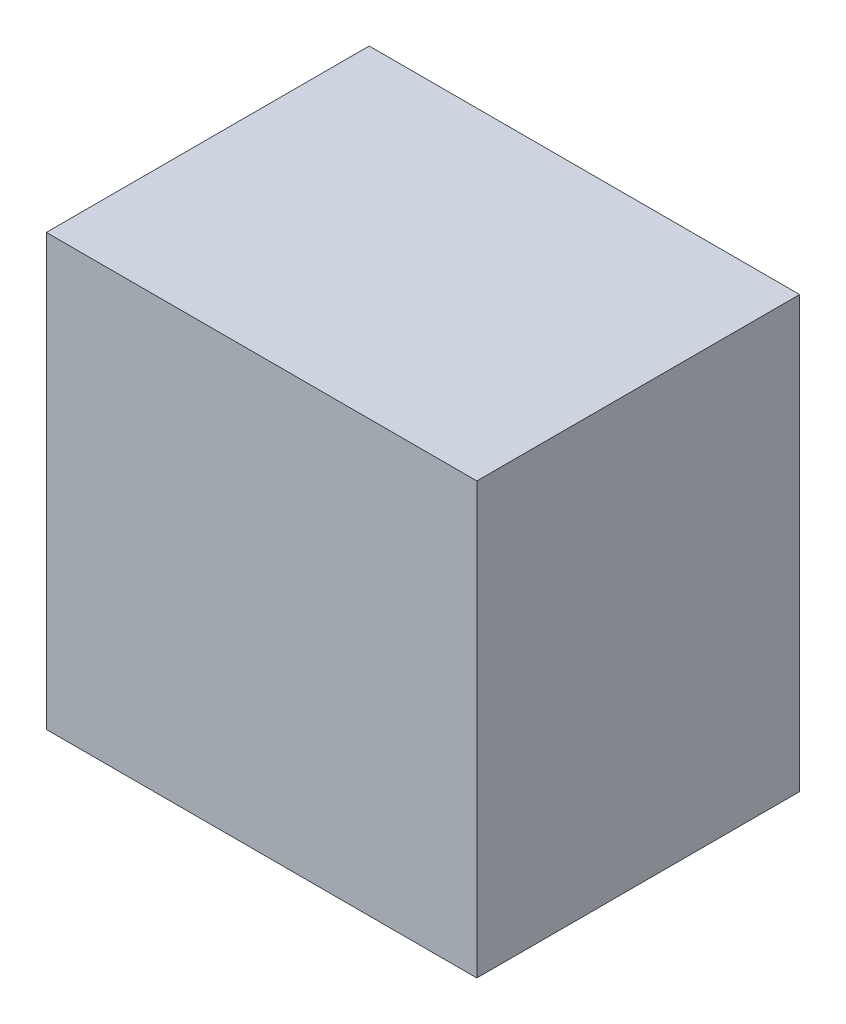
ISO-10303-21;
HEADER;
FILE_DESCRIPTION(('STEP AP214'),'2;1');
FILE_NAME('part.step','',(''),(''),'','','');
FILE_SCHEMA(('AUTOMOTIVE_DESIGN { 1 0 10303 214 1 1 1 1 }'));
ENDSEC;
DATA;
#1=APPLICATION_CONTEXT('core data for automotive mechanical design processes');
#2=APPLICATION_PROTOCOL_DEFINITION('international standard','automotive_design',2000,#1);
#3=PRODUCT_CONTEXT('',#1,'mechanical');
#4=PRODUCT('Part','Part','',(#3));
#5=PRODUCT_RELATED_PRODUCT_CATEGORY('part','',(#4));
#6=PRODUCT_DEFINITION_FORMATION('','',#4);
#7=PRODUCT_DEFINITION_CONTEXT('part definition',#1,'design');
#8=PRODUCT_DEFINITION('design','',#6,#7);
#9=PRODUCT_DEFINITION_SHAPE('','',#8);
#10=(LENGTH_UNIT() NAMED_UNIT(*) SI_UNIT(.MILLI.,.METRE.));
#11=(NAMED_UNIT(*) PLANE_ANGLE_UNIT() SI_UNIT($,.RADIAN.));
#12=(NAMED_UNIT(*) SI_UNIT($,.STERADIAN.) SOLID_ANGLE_UNIT());
#13=UNCERTAINTY_MEASURE_WITH_UNIT(LENGTH_MEASURE(1.E-05),#10,'distance_accuracy_value','');
#14=(GEOMETRIC_REPRESENTATION_CONTEXT(3) GLOBAL_UNCERTAINTY_ASSIGNED_CONTEXT((#13)) GLOBAL_UNIT_ASSIGNED_CONTEXT((#10,
#11,#12)) REPRESENTATION_CONTEXT('',''));
#15=CARTESIAN_POINT('',(0.,0.,0.));
#16=DIRECTION('',(0.,0.,1.));
#17=DIRECTION('',(1.,0.,0.));
#18=AXIS2_PLACEMENT_3D('',#15,#16,#17);
#19=CARTESIAN_POINT('',(0.,25.4,0.));
#20=DIRECTION('',(1.,0.,0.));
#21=DIRECTION('',(0.,0.,-1.));
#22=AXIS2_PLACEMENT_3D('',#19,#20,#21);
#23=PLANE('',#22);
#24=DIRECTION('',(0.,0.,1.));
#25=VECTOR('',#24,1.);
#26=CARTESIAN_POINT('',(0.,0.,0.));
#27=LINE('',#26,#25);
#28=CARTESIAN_POINT('',(0.,0.,-19.05));
#29=VERTEX_POINT('',#28);
#30=CARTESIAN_POINT('',(0.,0.,0.));
#31=VERTEX_POINT('',#30);
#32=EDGE_CURVE('E95',#29,#31,#27,.T.);
#33=ORIENTED_EDGE('',*,*,#32,.T.);
#34=DIRECTION('',(0.,-1.,0.));
#35=VECTOR('',#34,1.);
#36=CARTESIAN_POINT('',(0.,25.4,0.));
#37=LINE('',#36,#35);
#38=CARTESIAN_POINT('',(0.,25.4,0.));
#39=VERTEX_POINT('',#38);
#40=EDGE_CURVE('E11',#39,#31,#37,.T.);
#41=ORIENTED_EDGE('',*,*,#40,.F.);
#42=DIRECTION('',(0.,0.,1.));
#43=VECTOR('',#42,1.);
#44=CARTESIAN_POINT('',(0.,25.4,0.));
#45=LINE('',#44,#43);
#46=CARTESIAN_POINT('',(0.,25.4,-19.05));
#47=VERTEX_POINT('',#46);
#48=EDGE_CURVE('E83',#47,#39,#45,.T.);
#49=ORIENTED_EDGE('',*,*,#48,.F.);
#50=DIRECTION('',(0.,-1.,0.));
#51=VECTOR('',#50,1.);
#52=CARTESIAN_POINT('',(0.,25.4,-19.05));
#53=LINE('',#52,#51);
#54=EDGE_CURVE('E91',#47,#29,#53,.T.);
#55=ORIENTED_EDGE('',*,*,#54,.T.);
#56=EDGE_LOOP('',(#33,#41,#49,#55));
#57=FACE_BOUND('',#56,.T.);
#58=ADVANCED_FACE('F32',(#57),#23,.F.);
#59=CARTESIAN_POINT('',(0.,25.4,0.));
#60=DIRECTION('',(0.,0.,-1.));
#61=DIRECTION('',(-1.,0.,0.));
#62=AXIS2_PLACEMENT_3D('',#59,#60,#61);
#63=PLANE('',#62);
#64=DIRECTION('',(1.,0.,0.));
#65=VECTOR('',#64,1.);
#66=CARTESIAN_POINT('',(0.,0.,0.));
#67=LINE('',#66,#65);
#68=CARTESIAN_POINT('',(25.4,0.,0.));
#69=VERTEX_POINT('',#68);
#70=EDGE_CURVE('E87',#31,#69,#67,.T.);
#71=ORIENTED_EDGE('',*,*,#70,.T.);
#72=DIRECTION('',(0.,-1.,0.));
#73=VECTOR('',#72,1.);
#74=CARTESIAN_POINT('',(25.4,25.4,0.));
#75=LINE('',#74,#73);
#76=CARTESIAN_POINT('',(25.4,25.4,0.));
#77=VERTEX_POINT('',#76);
#78=EDGE_CURVE('E40',#77,#69,#75,.T.);
#79=ORIENTED_EDGE('',*,*,#78,.F.);
#80=DIRECTION('',(1.,0.,0.));
#81=VECTOR('',#80,1.);
#82=CARTESIAN_POINT('',(0.,25.4,0.));
#83=LINE('',#82,#81);
#84=EDGE_CURVE('E78',#39,#77,#83,.T.);
#85=ORIENTED_EDGE('',*,*,#84,.F.);
#86=ORIENTED_EDGE('',*,*,#40,.T.);
#87=EDGE_LOOP('',(#71,#79,#85,#86));
#88=FACE_BOUND('',#87,.T.);
#89=ADVANCED_FACE('F86',(#88),#63,.F.);
#90=CARTESIAN_POINT('',(25.4,25.4,0.));
#91=DIRECTION('',(-1.,0.,0.));
#92=DIRECTION('',(0.,0.,1.));
#93=AXIS2_PLACEMENT_3D('',#90,#91,#92);
#94=PLANE('',#93);
#95=DIRECTION('',(0.,0.,-1.));
#96=VECTOR('',#95,1.);
#97=CARTESIAN_POINT('',(25.4,0.,0.));
#98=LINE('',#97,#96);
#99=CARTESIAN_POINT('',(25.4,0.,-19.05));
#100=VERTEX_POINT('',#99);
#101=EDGE_CURVE('E65',#69,#100,#98,.T.);
#102=ORIENTED_EDGE('',*,*,#101,.T.);
#103=DIRECTION('',(0.,-1.,0.));
#104=VECTOR('',#103,1.);
#105=CARTESIAN_POINT('',(25.4,25.4,-19.05));
#106=LINE('',#105,#104);
#107=CARTESIAN_POINT('',(25.4,25.4,-19.05));
#108=VERTEX_POINT('',#107);
#109=EDGE_CURVE('E88',#108,#100,#106,.T.);
#110=ORIENTED_EDGE('',*,*,#109,.F.);
#111=DIRECTION('',(0.,0.,-1.));
#112=VECTOR('',#111,1.);
#113=CARTESIAN_POINT('',(25.4,25.4,0.));
#114=LINE('',#113,#112);
#115=EDGE_CURVE('E81',#77,#108,#114,.T.);
#116=ORIENTED_EDGE('',*,*,#115,.F.);
#117=ORIENTED_EDGE('',*,*,#78,.T.);
#118=EDGE_LOOP('',(#102,#110,#116,#117));
#119=FACE_BOUND('',#118,.T.);
#120=ADVANCED_FACE('F89',(#119),#94,.F.);
#121=CARTESIAN_POINT('',(0.,25.4,-19.05));
#122=DIRECTION('',(0.,0.,1.));
#123=DIRECTION('',(1.,0.,0.));
#124=AXIS2_PLACEMENT_3D('',#121,#122,#123);
#125=PLANE('',#124);
#126=DIRECTION('',(-1.,0.,0.));
#127=VECTOR('',#126,1.);
#128=CARTESIAN_POINT('',(0.,0.,-19.05));
#129=LINE('',#128,#127);
#130=EDGE_CURVE('E71',#100,#29,#129,.T.);
#131=ORIENTED_EDGE('',*,*,#130,.T.);
#132=ORIENTED_EDGE('',*,*,#54,.F.);
#133=DIRECTION('',(-1.,0.,0.));
#134=VECTOR('',#133,1.);
#135=CARTESIAN_POINT('',(0.,25.4,-19.05));
#136=LINE('',#135,#134);
#137=EDGE_CURVE('E48',#108,#47,#136,.T.);
#138=ORIENTED_EDGE('',*,*,#137,.F.);
#139=ORIENTED_EDGE('',*,*,#109,.T.);
#140=EDGE_LOOP('',(#131,#132,#138,#139));
#141=FACE_BOUND('',#140,.T.);
#142=ADVANCED_FACE('F102',(#141),#125,.F.);
#143=CARTESIAN_POINT('',(0.,25.4,0.));
#144=DIRECTION('',(0.,-1.,0.));
#145=DIRECTION('',(0.,0.,-1.));
#146=AXIS2_PLACEMENT_3D('',#143,#144,#145);
#147=PLANE('',#146);
#148=ORIENTED_EDGE('',*,*,#48,.T.);
#149=ORIENTED_EDGE('',*,*,#84,.T.);
#150=ORIENTED_EDGE('',*,*,#115,.T.);
#151=ORIENTED_EDGE('',*,*,#137,.T.);
#152=EDGE_LOOP('',(#148,#149,#150,#151));
#153=FACE_BOUND('',#152,.T.);
#154=ADVANCED_FACE('F79',(#153),#147,.F.);
#155=CARTESIAN_POINT('',(0.,0.,0.));
#156=DIRECTION('',(0.,-1.,0.));
#157=DIRECTION('',(0.,0.,-1.));
#158=AXIS2_PLACEMENT_3D('',#155,#156,#157);
#159=PLANE('',#158);
#160=ORIENTED_EDGE('',*,*,#32,.F.);
#161=ORIENTED_EDGE('',*,*,#130,.F.);
#162=ORIENTED_EDGE('',*,*,#101,.F.);
#163=ORIENTED_EDGE('',*,*,#70,.F.);
#164=EDGE_LOOP('',(#160,#161,#162,#163));
#165=FACE_BOUND('',#164,.T.);
#166=ADVANCED_FACE('F105',(#165),#159,.T.);
#167=CLOSED_SHELL('',(#58,#89,#120,#142,#154,#166));
#168=MANIFOLD_SOLID_BREP('B2',#167);
#169=ADVANCED_BREP_SHAPE_REPRESENTATION('',(#18,#168),#14);
#170=SHAPE_DEFINITION_REPRESENTATION(#9,#169);
ENDSEC;
END-ISO-10303-21;
